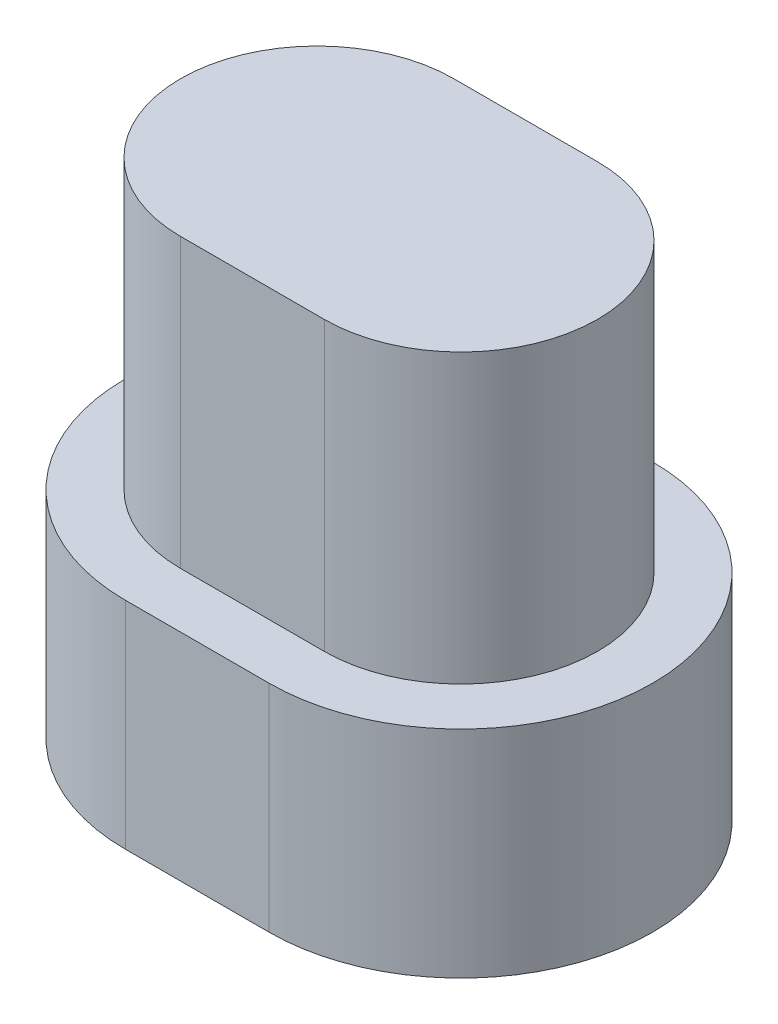
ISO-10303-21;
HEADER;
FILE_DESCRIPTION(('STEP AP214'),'2;1');
FILE_NAME('part.step','',(''),(''),'','','');
FILE_SCHEMA(('AUTOMOTIVE_DESIGN { 1 0 10303 214 1 1 1 1 }'));
ENDSEC;
DATA;
#1=APPLICATION_CONTEXT('core data for automotive mechanical design processes');
#2=APPLICATION_PROTOCOL_DEFINITION('international standard','automotive_design',2000,#1);
#3=PRODUCT_CONTEXT('',#1,'mechanical');
#4=PRODUCT('Part','Part','',(#3));
#5=PRODUCT_RELATED_PRODUCT_CATEGORY('part','',(#4));
#6=PRODUCT_DEFINITION_FORMATION('','',#4);
#7=PRODUCT_DEFINITION_CONTEXT('part definition',#1,'design');
#8=PRODUCT_DEFINITION('design','',#6,#7);
#9=PRODUCT_DEFINITION_SHAPE('','',#8);
#10=(LENGTH_UNIT() NAMED_UNIT(*) SI_UNIT(.MILLI.,.METRE.));
#11=(NAMED_UNIT(*) PLANE_ANGLE_UNIT() SI_UNIT($,.RADIAN.));
#12=(NAMED_UNIT(*) SI_UNIT($,.STERADIAN.) SOLID_ANGLE_UNIT());
#13=UNCERTAINTY_MEASURE_WITH_UNIT(LENGTH_MEASURE(1.E-05),#10,'distance_accuracy_value','');
#14=(GEOMETRIC_REPRESENTATION_CONTEXT(3) GLOBAL_UNCERTAINTY_ASSIGNED_CONTEXT((#13)) GLOBAL_UNIT_ASSIGNED_CONTEXT((#10,
#11,#12)) REPRESENTATION_CONTEXT('',''));
#15=CARTESIAN_POINT('',(0.,0.,0.));
#16=DIRECTION('',(0.,0.,1.));
#17=DIRECTION('',(1.,0.,0.));
#18=AXIS2_PLACEMENT_3D('',#15,#16,#17);
#19=CARTESIAN_POINT('',(0.,6.,0.));
#20=DIRECTION('',(0.,-1.,0.));
#21=DIRECTION('',(0.,0.,-1.));
#22=AXIS2_PLACEMENT_3D('',#19,#20,#21);
#23=CYLINDRICAL_SURFACE('',#22,2.85);
#24=CARTESIAN_POINT('',(0.,0.,0.));
#25=DIRECTION('',(0.,1.,0.));
#26=DIRECTION('',(0.,0.,1.));
#27=AXIS2_PLACEMENT_3D('',#24,#25,#26);
#28=CIRCLE('',#27,2.85);
#29=CARTESIAN_POINT('',(0.,0.,-2.85));
#30=VERTEX_POINT('',#29);
#31=CARTESIAN_POINT('',(0.,0.,2.85));
#32=VERTEX_POINT('',#31);
#33=EDGE_CURVE('E124',#30,#32,#28,.T.);
#34=ORIENTED_EDGE('',*,*,#33,.T.);
#35=DIRECTION('',(0.,-1.,0.));
#36=VECTOR('',#35,1.);
#37=CARTESIAN_POINT('',(0.,6.,2.85));
#38=LINE('',#37,#36);
#39=CARTESIAN_POINT('',(0.,6.,2.85));
#40=VERTEX_POINT('',#39);
#41=EDGE_CURVE('E11',#40,#32,#38,.T.);
#42=ORIENTED_EDGE('',*,*,#41,.F.);
#43=CARTESIAN_POINT('',(0.,6.,0.));
#44=DIRECTION('',(0.,1.,0.));
#45=DIRECTION('',(0.,0.,1.));
#46=AXIS2_PLACEMENT_3D('',#43,#44,#45);
#47=CIRCLE('',#46,2.85);
#48=CARTESIAN_POINT('',(0.,6.,-2.85));
#49=VERTEX_POINT('',#48);
#50=EDGE_CURVE('E133',#49,#40,#47,.T.);
#51=ORIENTED_EDGE('',*,*,#50,.F.);
#52=DIRECTION('',(0.,-1.,0.));
#53=VECTOR('',#52,1.);
#54=CARTESIAN_POINT('',(0.,6.,-2.85));
#55=LINE('',#54,#53);
#56=EDGE_CURVE('E140',#49,#30,#55,.T.);
#57=ORIENTED_EDGE('',*,*,#56,.T.);
#58=EDGE_LOOP('',(#34,#42,#51,#57));
#59=FACE_BOUND('',#58,.T.);
#60=ADVANCED_FACE('F39',(#59),#23,.T.);
#61=CARTESIAN_POINT('',(0.,6.,2.85));
#62=DIRECTION('',(0.,0.,-1.));
#63=DIRECTION('',(-1.,0.,0.));
#64=AXIS2_PLACEMENT_3D('',#61,#62,#63);
#65=PLANE('',#64);
#66=DIRECTION('',(1.,0.,0.));
#67=VECTOR('',#66,1.);
#68=CARTESIAN_POINT('',(0.,0.,2.85));
#69=LINE('',#68,#67);
#70=CARTESIAN_POINT('',(3.,0.,2.85));
#71=VERTEX_POINT('',#70);
#72=EDGE_CURVE('E127',#32,#71,#69,.T.);
#73=ORIENTED_EDGE('',*,*,#72,.T.);
#74=DIRECTION('',(0.,-1.,0.));
#75=VECTOR('',#74,1.);
#76=CARTESIAN_POINT('',(3.,6.,2.85));
#77=LINE('',#76,#75);
#78=CARTESIAN_POINT('',(3.,6.,2.85));
#79=VERTEX_POINT('',#78);
#80=EDGE_CURVE('E47',#79,#71,#77,.T.);
#81=ORIENTED_EDGE('',*,*,#80,.F.);
#82=DIRECTION('',(1.,0.,0.));
#83=VECTOR('',#82,1.);
#84=CARTESIAN_POINT('',(0.,6.,2.85));
#85=LINE('',#84,#83);
#86=EDGE_CURVE('E135',#40,#79,#85,.T.);
#87=ORIENTED_EDGE('',*,*,#86,.F.);
#88=ORIENTED_EDGE('',*,*,#41,.T.);
#89=EDGE_LOOP('',(#73,#81,#87,#88));
#90=FACE_BOUND('',#89,.T.);
#91=ADVANCED_FACE('F161',(#90),#65,.F.);
#92=CARTESIAN_POINT('',(3.,6.,0.));
#93=DIRECTION('',(0.,-1.,0.));
#94=DIRECTION('',(0.,0.,-1.));
#95=AXIS2_PLACEMENT_3D('',#92,#93,#94);
#96=CYLINDRICAL_SURFACE('',#95,2.85);
#97=CARTESIAN_POINT('',(3.,0.,0.));
#98=DIRECTION('',(0.,1.,0.));
#99=DIRECTION('',(0.,0.,1.));
#100=AXIS2_PLACEMENT_3D('',#97,#98,#99);
#101=CIRCLE('',#100,2.85);
#102=CARTESIAN_POINT('',(3.,0.,-2.85));
#103=VERTEX_POINT('',#102);
#104=EDGE_CURVE('E144',#71,#103,#101,.T.);
#105=ORIENTED_EDGE('',*,*,#104,.T.);
#106=DIRECTION('',(0.,-1.,0.));
#107=VECTOR('',#106,1.);
#108=CARTESIAN_POINT('',(3.,6.,-2.85));
#109=LINE('',#108,#107);
#110=CARTESIAN_POINT('',(3.,6.,-2.85));
#111=VERTEX_POINT('',#110);
#112=EDGE_CURVE('E151',#111,#103,#109,.T.);
#113=ORIENTED_EDGE('',*,*,#112,.F.);
#114=CARTESIAN_POINT('',(3.,6.,0.));
#115=DIRECTION('',(0.,1.,0.));
#116=DIRECTION('',(0.,0.,1.));
#117=AXIS2_PLACEMENT_3D('',#114,#115,#116);
#118=CIRCLE('',#117,2.85);
#119=EDGE_CURVE('E138',#79,#111,#118,.T.);
#120=ORIENTED_EDGE('',*,*,#119,.F.);
#121=ORIENTED_EDGE('',*,*,#80,.T.);
#122=EDGE_LOOP('',(#105,#113,#120,#121));
#123=FACE_BOUND('',#122,.T.);
#124=ADVANCED_FACE('F157',(#123),#96,.T.);
#125=CARTESIAN_POINT('',(0.,6.,-2.85));
#126=DIRECTION('',(0.,0.,1.));
#127=DIRECTION('',(1.,0.,0.));
#128=AXIS2_PLACEMENT_3D('',#125,#126,#127);
#129=PLANE('',#128);
#130=DIRECTION('',(-1.,0.,0.));
#131=VECTOR('',#130,1.);
#132=CARTESIAN_POINT('',(0.,0.,-2.85));
#133=LINE('',#132,#131);
#134=EDGE_CURVE('E136',#103,#30,#133,.T.);
#135=ORIENTED_EDGE('',*,*,#134,.T.);
#136=ORIENTED_EDGE('',*,*,#56,.F.);
#137=DIRECTION('',(-1.,0.,0.));
#138=VECTOR('',#137,1.);
#139=CARTESIAN_POINT('',(0.,6.,-2.85));
#140=LINE('',#139,#138);
#141=EDGE_CURVE('E54',#111,#49,#140,.T.);
#142=ORIENTED_EDGE('',*,*,#141,.F.);
#143=ORIENTED_EDGE('',*,*,#112,.T.);
#144=EDGE_LOOP('',(#135,#136,#142,#143));
#145=FACE_BOUND('',#144,.T.);
#146=ADVANCED_FACE('F167',(#145),#129,.F.);
#147=CARTESIAN_POINT('',(0.,6.,0.));
#148=DIRECTION('',(0.,1.,0.));
#149=DIRECTION('',(0.,0.,1.));
#150=AXIS2_PLACEMENT_3D('',#147,#148,#149);
#151=PLANE('',#150);
#152=ORIENTED_EDGE('',*,*,#50,.T.);
#153=ORIENTED_EDGE('',*,*,#86,.T.);
#154=ORIENTED_EDGE('',*,*,#119,.T.);
#155=ORIENTED_EDGE('',*,*,#141,.T.);
#156=EDGE_LOOP('',(#152,#153,#154,#155));
#157=FACE_BOUND('',#156,.T.);
#158=ADVANCED_FACE('F170',(#157),#151,.T.);
#159=CARTESIAN_POINT('',(0.,-4.5,0.));
#160=DIRECTION('',(0.,1.,0.));
#161=DIRECTION('',(0.,0.,1.));
#162=AXIS2_PLACEMENT_3D('',#159,#160,#161);
#163=CYLINDRICAL_SURFACE('',#162,4.);
#164=CARTESIAN_POINT('',(0.,0.,0.));
#165=DIRECTION('',(0.,-1.,0.));
#166=DIRECTION('',(0.,0.,-1.));
#167=AXIS2_PLACEMENT_3D('',#164,#165,#166);
#168=CIRCLE('',#167,4.);
#169=CARTESIAN_POINT('',(0.,0.,4.));
#170=VERTEX_POINT('',#169);
#171=CARTESIAN_POINT('',(0.,0.,-4.));
#172=VERTEX_POINT('',#171);
#173=EDGE_CURVE('E123',#170,#172,#168,.T.);
#174=ORIENTED_EDGE('',*,*,#173,.T.);
#175=DIRECTION('',(0.,1.,0.));
#176=VECTOR('',#175,1.);
#177=CARTESIAN_POINT('',(0.,-4.5,-4.));
#178=LINE('',#177,#176);
#179=CARTESIAN_POINT('',(0.,-4.5,-4.));
#180=VERTEX_POINT('',#179);
#181=EDGE_CURVE('E103',#180,#172,#178,.T.);
#182=ORIENTED_EDGE('',*,*,#181,.F.);
#183=CARTESIAN_POINT('',(0.,-4.5,0.));
#184=DIRECTION('',(0.,-1.,0.));
#185=DIRECTION('',(0.,0.,-1.));
#186=AXIS2_PLACEMENT_3D('',#183,#184,#185);
#187=CIRCLE('',#186,4.);
#188=CARTESIAN_POINT('',(0.,-4.5,4.));
#189=VERTEX_POINT('',#188);
#190=EDGE_CURVE('E110',#189,#180,#187,.T.);
#191=ORIENTED_EDGE('',*,*,#190,.F.);
#192=DIRECTION('',(0.,1.,0.));
#193=VECTOR('',#192,1.);
#194=CARTESIAN_POINT('',(0.,-4.5,4.));
#195=LINE('',#194,#193);
#196=EDGE_CURVE('E285',#189,#170,#195,.T.);
#197=ORIENTED_EDGE('',*,*,#196,.T.);
#198=EDGE_LOOP('',(#174,#182,#191,#197));
#199=FACE_BOUND('',#198,.T.);
#200=ADVANCED_FACE('F121',(#199),#163,.T.);
#201=CARTESIAN_POINT('',(0.,-4.5,-4.));
#202=DIRECTION('',(0.,0.,1.));
#203=DIRECTION('',(1.,0.,0.));
#204=AXIS2_PLACEMENT_3D('',#201,#202,#203);
#205=PLANE('',#204);
#206=DIRECTION('',(1.,0.,0.));
#207=VECTOR('',#206,1.);
#208=CARTESIAN_POINT('',(0.,0.,-4.));
#209=LINE('',#208,#207);
#210=CARTESIAN_POINT('',(3.,0.,-4.));
#211=VERTEX_POINT('',#210);
#212=EDGE_CURVE('E291',#172,#211,#209,.T.);
#213=ORIENTED_EDGE('',*,*,#212,.T.);
#214=DIRECTION('',(0.,1.,0.));
#215=VECTOR('',#214,1.);
#216=CARTESIAN_POINT('',(3.,-4.5,-4.));
#217=LINE('',#216,#215);
#218=CARTESIAN_POINT('',(3.,-4.5,-4.));
#219=VERTEX_POINT('',#218);
#220=EDGE_CURVE('E106',#219,#211,#217,.T.);
#221=ORIENTED_EDGE('',*,*,#220,.F.);
#222=DIRECTION('',(1.,0.,0.));
#223=VECTOR('',#222,1.);
#224=CARTESIAN_POINT('',(0.,-4.5,-4.));
#225=LINE('',#224,#223);
#226=EDGE_CURVE('E99',#180,#219,#225,.T.);
#227=ORIENTED_EDGE('',*,*,#226,.F.);
#228=ORIENTED_EDGE('',*,*,#181,.T.);
#229=EDGE_LOOP('',(#213,#221,#227,#228));
#230=FACE_BOUND('',#229,.T.);
#231=ADVANCED_FACE('F101',(#230),#205,.F.);
#232=CARTESIAN_POINT('',(3.,-4.5,0.));
#233=DIRECTION('',(0.,1.,0.));
#234=DIRECTION('',(0.,0.,1.));
#235=AXIS2_PLACEMENT_3D('',#232,#233,#234);
#236=CYLINDRICAL_SURFACE('',#235,4.);
#237=CARTESIAN_POINT('',(3.,0.,0.));
#238=DIRECTION('',(0.,-1.,0.));
#239=DIRECTION('',(0.,0.,-1.));
#240=AXIS2_PLACEMENT_3D('',#237,#238,#239);
#241=CIRCLE('',#240,4.);
#242=CARTESIAN_POINT('',(3.,0.,4.));
#243=VERTEX_POINT('',#242);
#244=EDGE_CURVE('E288',#211,#243,#241,.T.);
#245=ORIENTED_EDGE('',*,*,#244,.T.);
#246=DIRECTION('',(0.,1.,0.));
#247=VECTOR('',#246,1.);
#248=CARTESIAN_POINT('',(3.,-4.5,4.));
#249=LINE('',#248,#247);
#250=CARTESIAN_POINT('',(3.,-4.5,4.));
#251=VERTEX_POINT('',#250);
#252=EDGE_CURVE('E129',#251,#243,#249,.T.);
#253=ORIENTED_EDGE('',*,*,#252,.F.);
#254=CARTESIAN_POINT('',(3.,-4.5,0.));
#255=DIRECTION('',(0.,-1.,0.));
#256=DIRECTION('',(0.,0.,-1.));
#257=AXIS2_PLACEMENT_3D('',#254,#255,#256);
#258=CIRCLE('',#257,4.);
#259=EDGE_CURVE('E109',#219,#251,#258,.T.);
#260=ORIENTED_EDGE('',*,*,#259,.F.);
#261=ORIENTED_EDGE('',*,*,#220,.T.);
#262=EDGE_LOOP('',(#245,#253,#260,#261));
#263=FACE_BOUND('',#262,.T.);
#264=ADVANCED_FACE('F211',(#263),#236,.T.);
#265=CARTESIAN_POINT('',(0.,-4.5,4.));
#266=DIRECTION('',(0.,0.,-1.));
#267=DIRECTION('',(-1.,0.,0.));
#268=AXIS2_PLACEMENT_3D('',#265,#266,#267);
#269=PLANE('',#268);
#270=DIRECTION('',(-1.,0.,0.));
#271=VECTOR('',#270,1.);
#272=CARTESIAN_POINT('',(0.,0.,4.));
#273=LINE('',#272,#271);
#274=EDGE_CURVE('E119',#243,#170,#273,.T.);
#275=ORIENTED_EDGE('',*,*,#274,.T.);
#276=ORIENTED_EDGE('',*,*,#196,.F.);
#277=DIRECTION('',(-1.,0.,0.));
#278=VECTOR('',#277,1.);
#279=CARTESIAN_POINT('',(0.,-4.5,4.));
#280=LINE('',#279,#278);
#281=EDGE_CURVE('E115',#251,#189,#280,.T.);
#282=ORIENTED_EDGE('',*,*,#281,.F.);
#283=ORIENTED_EDGE('',*,*,#252,.T.);
#284=EDGE_LOOP('',(#275,#276,#282,#283));
#285=FACE_BOUND('',#284,.T.);
#286=ADVANCED_FACE('F221',(#285),#269,.F.);
#287=CARTESIAN_POINT('',(0.,-4.5,0.));
#288=DIRECTION('',(0.,-1.,0.));
#289=DIRECTION('',(0.,0.,-1.));
#290=AXIS2_PLACEMENT_3D('',#287,#288,#289);
#291=PLANE('',#290);
#292=ORIENTED_EDGE('',*,*,#190,.T.);
#293=ORIENTED_EDGE('',*,*,#226,.T.);
#294=ORIENTED_EDGE('',*,*,#259,.T.);
#295=ORIENTED_EDGE('',*,*,#281,.T.);
#296=EDGE_LOOP('',(#292,#293,#294,#295));
#297=FACE_BOUND('',#296,.T.);
#298=ADVANCED_FACE('F113',(#297),#291,.T.);
#299=CARTESIAN_POINT('',(0.,0.,0.));
#300=DIRECTION('',(0.,-1.,0.));
#301=DIRECTION('',(0.,0.,-1.));
#302=AXIS2_PLACEMENT_3D('',#299,#300,#301);
#303=PLANE('',#302);
#304=ORIENTED_EDGE('',*,*,#33,.F.);
#305=ORIENTED_EDGE('',*,*,#134,.F.);
#306=ORIENTED_EDGE('',*,*,#104,.F.);
#307=ORIENTED_EDGE('',*,*,#72,.F.);
#308=EDGE_LOOP('',(#304,#305,#306,#307));
#309=FACE_BOUND('',#308,.T.);
#310=ORIENTED_EDGE('',*,*,#173,.F.);
#311=ORIENTED_EDGE('',*,*,#274,.F.);
#312=ORIENTED_EDGE('',*,*,#244,.F.);
#313=ORIENTED_EDGE('',*,*,#212,.F.);
#314=EDGE_LOOP('',(#310,#311,#312,#313));
#315=FACE_BOUND('',#314,.T.);
#316=ADVANCED_FACE('F164',(#309,#315),#303,.F.);
#317=CLOSED_SHELL('',(#60,#91,#124,#146,#158,#200,#231,#264,#286,#298,#316));
#318=MANIFOLD_SOLID_BREP('B2',#317);
#319=ADVANCED_BREP_SHAPE_REPRESENTATION('',(#18,#318),#14);
#320=SHAPE_DEFINITION_REPRESENTATION(#9,#319);
ENDSEC;
END-ISO-10303-21;
